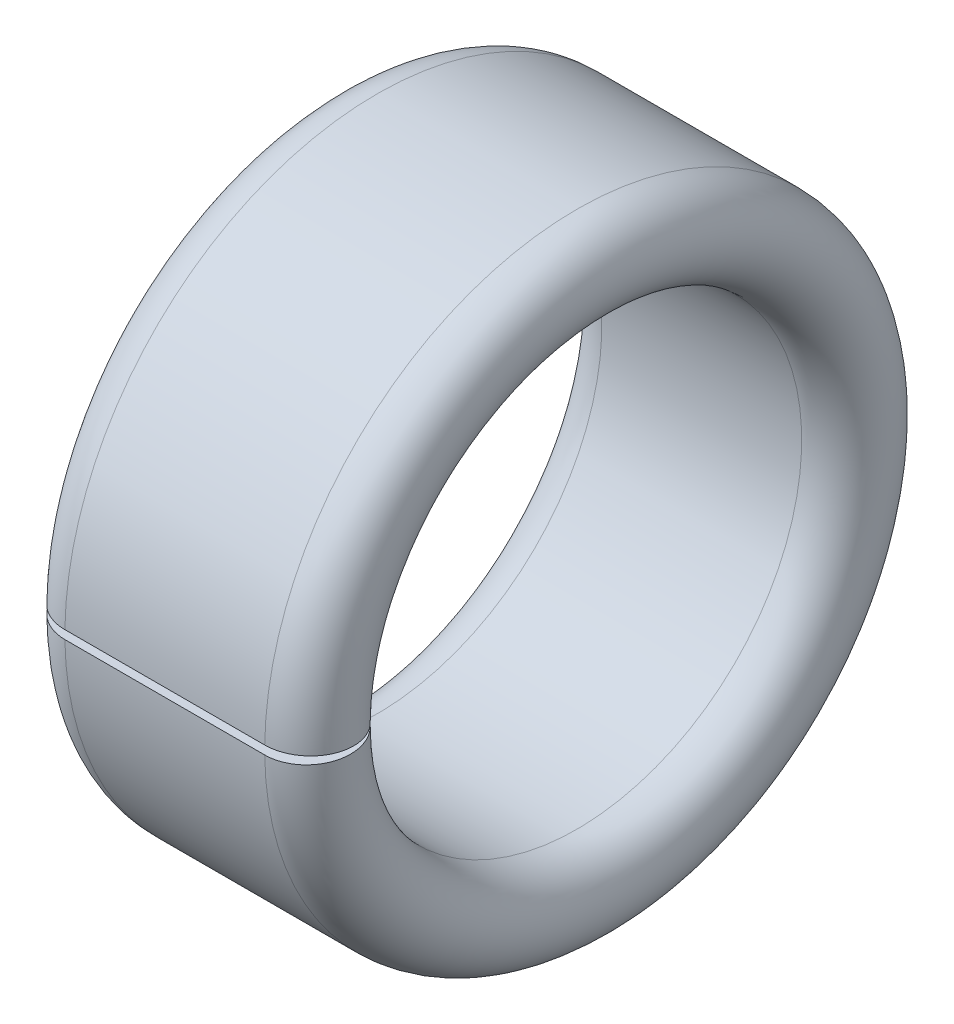
ISO-10303-21;
HEADER;
FILE_DESCRIPTION(('STEP AP214'),'2;1');
FILE_NAME('part.step','',(''),(''),'','','');
FILE_SCHEMA(('AUTOMOTIVE_DESIGN { 1 0 10303 214 1 1 1 1 }'));
ENDSEC;
DATA;
#1=APPLICATION_CONTEXT('core data for automotive mechanical design processes');
#2=APPLICATION_PROTOCOL_DEFINITION('international standard','automotive_design',2000,#1);
#3=PRODUCT_CONTEXT('',#1,'mechanical');
#4=PRODUCT('Part','Part','',(#3));
#5=PRODUCT_RELATED_PRODUCT_CATEGORY('part','',(#4));
#6=PRODUCT_DEFINITION_FORMATION('','',#4);
#7=PRODUCT_DEFINITION_CONTEXT('part definition',#1,'design');
#8=PRODUCT_DEFINITION('design','',#6,#7);
#9=PRODUCT_DEFINITION_SHAPE('','',#8);
#10=(LENGTH_UNIT() NAMED_UNIT(*) SI_UNIT(.MILLI.,.METRE.));
#11=(NAMED_UNIT(*) PLANE_ANGLE_UNIT() SI_UNIT($,.RADIAN.));
#12=(NAMED_UNIT(*) SI_UNIT($,.STERADIAN.) SOLID_ANGLE_UNIT());
#13=UNCERTAINTY_MEASURE_WITH_UNIT(LENGTH_MEASURE(1.E-05),#10,'distance_accuracy_value','');
#14=(GEOMETRIC_REPRESENTATION_CONTEXT(3) GLOBAL_UNCERTAINTY_ASSIGNED_CONTEXT((#13)) GLOBAL_UNIT_ASSIGNED_CONTEXT((#10,
#11,#12)) REPRESENTATION_CONTEXT('',''));
#15=CARTESIAN_POINT('',(0.,0.,0.));
#16=DIRECTION('',(0.,0.,1.));
#17=DIRECTION('',(1.,0.,0.));
#18=AXIS2_PLACEMENT_3D('',#15,#16,#17);
#19=CARTESIAN_POINT('',(0.35,0.,0.));
#20=DIRECTION('',(1.,0.,0.));
#21=DIRECTION('',(0.,0.,-1.));
#22=AXIS2_PLACEMENT_3D('',#19,#20,#21);
#23=TOROIDAL_SURFACE('',#22,2.15,0.35);
#24=CARTESIAN_POINT('',(0.35,0.,0.));
#25=DIRECTION('',(1.,0.,0.));
#26=DIRECTION('',(0.,0.,-1.));
#27=AXIS2_PLACEMENT_3D('',#24,#25,#26);
#28=CIRCLE('',#27,2.5);
#29=CARTESIAN_POINT('',(0.35,-0.034437225614834,2.49976280424603));
#30=VERTEX_POINT('',#29);
#31=CARTESIAN_POINT('',(0.35,0.0344372256148345,2.49976280424603));
#32=VERTEX_POINT('',#31);
#33=EDGE_CURVE('E85',#30,#32,#28,.T.);
#34=ORIENTED_EDGE('',*,*,#33,.F.);
#35=CARTESIAN_POINT('',(0.350199999999993,-0.0344372236201316,2.49976274712522));
#36=CARTESIAN_POINT('',(0.330513458890037,-0.0344382003940765,2.49979071827131));
#37=CARTESIAN_POINT('',(0.310830965609943,-0.0343800637703141,2.49812590318823));
#38=CARTESIAN_POINT('',(0.272035014909187,-0.0341498576529001,2.49153366250269));
#39=CARTESIAN_POINT('',(0.252921148691738,-0.0339778721822131,2.48660864300312));
#40=CARTESIAN_POINT('',(0.215784172977495,-0.0335241464089628,2.47361563683933));
#41=CARTESIAN_POINT('',(0.197761571854169,-0.0332423554003737,2.46554619814453));
#42=CARTESIAN_POINT('',(0.163330811070095,-0.0325772791095271,2.44650090502738));
#43=CARTESIAN_POINT('',(0.146922337413878,-0.0321940136208154,2.43552561741803));
#44=CARTESIAN_POINT('',(0.116179705652343,-0.0313367501225348,2.41097680275107));
#45=CARTESIAN_POINT('',(0.101845779744151,-0.0308627419702157,2.39740298524309));
#46=CARTESIAN_POINT('',(0.0756588001346326,-0.0298374149458111,2.36804146087442));
#47=CARTESIAN_POINT('',(0.0638061264881228,-0.0292860842517538,2.35225341547675));
#48=CARTESIAN_POINT('',(0.0429186221217634,-0.0281217165310652,2.31891028651266));
#49=CARTESIAN_POINT('',(0.0338842737645812,-0.0275086689651767,2.3013549011414));
#50=CARTESIAN_POINT('',(0.0188926400177474,-0.0262383910918137,2.2649789022201));
#51=CARTESIAN_POINT('',(0.012935162053471,-0.0255811635523782,2.24615836793631));
#52=CARTESIAN_POINT('',(0.00426387190833058,-0.0242409560526566,2.20777984652262));
#53=CARTESIAN_POINT('',(0.00155093851061013,-0.0235579691671118,2.18822166107925));
#54=CARTESIAN_POINT('',(-0.000551639414875153,-0.0221857771979768,2.14892722429832));
#55=CARTESIAN_POINT('',(5.87969882696782E-05,-0.021496571963365,2.12919096863606));
#56=CARTESIAN_POINT('',(0.00458610490793072,-0.0201313888480275,2.09009723916769));
#57=CARTESIAN_POINT('',(0.00850358486050442,-0.019455413424765,2.07073983573412));
#58=CARTESIAN_POINT('',(0.0195346148135306,-0.0181360101421559,2.03295706915102));
#59=CARTESIAN_POINT('',(0.0266481559721307,-0.0174925821927729,2.01453170342318));
#60=CARTESIAN_POINT('',(0.0438701104696195,-0.0162565018767181,1.97913499441461));
#61=CARTESIAN_POINT('',(0.0539787024048156,-0.015663852540717,1.96216373792093));
#62=CARTESIAN_POINT('',(0.0769034192872924,-0.0145462368081082,1.93015941072897));
#63=CARTESIAN_POINT('',(0.0897194111551644,-0.0140212670868214,1.91512624482434));
#64=CARTESIAN_POINT('',(0.117690994856155,-0.0130540545964116,1.88742890297056));
#65=CARTESIAN_POINT('',(0.132845828529518,-0.0126117851215345,1.87476396226868));
#66=CARTESIAN_POINT('',(0.165073826325424,-0.0118222226740318,1.85215385203931));
#67=CARTESIAN_POINT('',(0.18214758911785,-0.0114749594582661,1.84220953463681));
#68=CARTESIAN_POINT('',(0.217726978456363,-0.0108853833302602,1.82532628330567));
#69=CARTESIAN_POINT('',(0.236232945258549,-0.0106430954483228,1.81838806615113));
#70=CARTESIAN_POINT('',(0.274125105899796,-0.0102708983639453,1.80772973617173));
#71=CARTESIAN_POINT('',(0.293509915155594,-0.0101408184429499,1.80400473460709));
#72=CARTESIAN_POINT('',(0.325398207803402,-0.0100224549985587,1.80061524903406));
#73=CARTESIAN_POINT('',(0.3378025231833,-0.009999567069746,1.79995982450746));
#74=CARTESIAN_POINT('',(0.3502,-0.0100000019951171,1.79997227914054));
#75=B_SPLINE_CURVE_WITH_KNOTS('',3,(#35,#36,#37,#38,#39,#40,#41,#42,#43,#44,#45,#46,#47,#48,#49,
#50,#51,#52,#53,#54,#55,#56,#57,#58,#59,#60,#61,#62,#63,#64,#65,#66,#67,#68,#69,#70,#71,#72,#73,
#74),.UNSPECIFIED.,.F.,.F.,(4,2,2,2,2,2,2,2,2,2,2,2,2,2,2,2,2,2,2,4),(0.,0.0589811664257136,
0.117918851905634,0.176883785957539,0.235837226810727,0.294797261029061,0.353766319592167,
0.412745465311087,0.471720919206101,0.530712342956034,0.589705203275241,0.648708919577286,
0.707712472647497,0.766719544836096,0.825723717268441,0.884708802907901,0.943712342139064,
1.00272994243301,1.06165759135075,1.09884949494485),.UNSPECIFIED.);
#76=CARTESIAN_POINT('',(0.35,-0.0100000000000007,1.79997222200788));
#77=VERTEX_POINT('',#76);
#78=EDGE_CURVE('E64',#30,#77,#75,.T.);
#79=ORIENTED_EDGE('',*,*,#78,.T.);
#80=CARTESIAN_POINT('',(0.35,0.,0.));
#81=DIRECTION('',(1.,0.,0.));
#82=DIRECTION('',(0.,0.,-1.));
#83=AXIS2_PLACEMENT_3D('',#80,#81,#82);
#84=CIRCLE('',#83,1.8);
#85=CARTESIAN_POINT('',(0.35,0.0100000000000008,1.79997222200788));
#86=VERTEX_POINT('',#85);
#87=EDGE_CURVE('E87',#77,#86,#84,.T.);
#88=ORIENTED_EDGE('',*,*,#87,.T.);
#89=CARTESIAN_POINT('',(0.3502,0.0100000019951173,1.79997227914054));
#90=CARTESIAN_POINT('',(0.330515938498373,0.00999902429166176,1.79994428137676));
#91=CARTESIAN_POINT('',(0.310835961254501,0.0100571591381759,1.8016090455661));
#92=CARTESIAN_POINT('',(0.272045185273763,0.0102873517463833,1.80820089939858));
#93=CARTESIAN_POINT('',(0.252933973377943,0.0104593245939787,1.81312555742011));
#94=CARTESIAN_POINT('',(0.215802252574514,0.010913006349621,1.82611730308452));
#95=CARTESIAN_POINT('',(0.197782248660242,0.0111947656233416,1.83418583301159));
#96=CARTESIAN_POINT('',(0.163356222514488,0.0118597514005395,1.85322853415697));
#97=CARTESIAN_POINT('',(0.146949890510401,0.0122429583770062,1.86420214619485));
#98=CARTESIAN_POINT('',(0.116208852031249,0.0131001253164631,1.88874819577888));
#99=CARTESIAN_POINT('',(0.101874628389184,0.0135741063715801,1.90232123732451));
#100=CARTESIAN_POINT('',(0.0756864298511128,0.0145993681379304,1.93168089294701));
#101=CARTESIAN_POINT('',(0.0638328365701148,0.0151506607208536,1.94746784698459));
#102=CARTESIAN_POINT('',(0.0429408569269419,0.0163150478121653,1.98081153065075));
#103=CARTESIAN_POINT('',(0.0339034415809807,0.0169281635408999,1.99836886795053));
#104=CARTESIAN_POINT('',(0.0189059527384616,0.018198594106753,2.03474923941266));
#105=CARTESIAN_POINT('',(0.0129456877382525,0.0188559061904733,2.053572194728));
#106=CARTESIAN_POINT('',(0.0042692865198731,0.0201963137416161,2.09195644486486));
#107=CARTESIAN_POINT('',(0.00155410028383804,0.0208794166988561,2.11151795416669));
#108=CARTESIAN_POINT('',(-0.000551891446526203,0.0222518520487528,2.15081936046076));
#109=CARTESIAN_POINT('',(5.73814973008942E-05,0.0229411845880087,2.17055926165105));
#110=CARTESIAN_POINT('',(0.0045834806945544,0.0243065240678065,2.2096574688117));
#111=CARTESIAN_POINT('',(0.00850044204764825,0.0249825304628994,2.22901575916245));
#112=CARTESIAN_POINT('',(0.0195311834193477,0.0263019902026011,2.26680014246516));
#113=CARTESIAN_POINT('',(0.0266449509364822,0.0269454436745008,2.28522623906225));
#114=CARTESIAN_POINT('',(0.0438666278357914,0.0281814497960515,2.32062082341821));
#115=CARTESIAN_POINT('',(0.0539741867901772,0.0287740083925582,2.33758948147275));
#116=CARTESIAN_POINT('',(0.0768965581244986,0.0298914453275343,2.36958868857041));
#117=CARTESIAN_POINT('',(0.0897112361825411,0.0304163270219176,2.38461933371434));
#118=CARTESIAN_POINT('',(0.117679090604668,0.0313833471943485,2.41231116830176));
#119=CARTESIAN_POINT('',(0.132831391788907,0.0318255165024694,2.42497324060304));
#120=CARTESIAN_POINT('',(0.165053643126108,0.0326149080081673,2.44757845569959));
#121=CARTESIAN_POINT('',(0.182124192558459,0.032962100417046,2.45752074545814));
#122=CARTESIAN_POINT('',(0.217698838841015,0.0335516179580683,2.47440231907758));
#123=CARTESIAN_POINT('',(0.236203457411164,0.033793904711969,2.48134050392937));
#124=CARTESIAN_POINT('',(0.274092823059593,0.0341661314736564,2.49199968375573));
#125=CARTESIAN_POINT('',(0.29347618808616,0.0342962418678955,2.49572555795991));
#126=CARTESIAN_POINT('',(0.325374713458365,0.0344147320832872,2.49911867377941));
#127=CARTESIAN_POINT('',(0.337790777653349,0.03443765875606,2.49977520778787));
#128=CARTESIAN_POINT('',(0.350199999999993,0.0344372236201321,2.49976274712522));
#129=B_SPLINE_CURVE_WITH_KNOTS('',3,(#89,#90,#91,#92,#93,#94,#95,#96,#97,#98,#99,#100,#101,#102,
#103,#104,#105,#106,#107,#108,#109,#110,#111,#112,#113,#114,#115,#116,#117,#118,#119,#120,#121,
#122,#123,#124,#125,#126,#127,#128),.UNSPECIFIED.,.F.,.F.,(4,2,2,2,2,2,2,2,2,2,2,2,2,2,2,2,2,2,
2,4),(0.,0.058973663687536,0.117903387205865,0.176860177242991,0.235805627310535,
0.294764790507213,0.35373301720201,0.412721553660604,0.471706418578654,0.53070854682295,
0.589712067184856,0.648717997611003,0.707723697289811,0.766722492990353,0.825718361974688,
0.884692196930312,0.943684507376887,1.00269838112451,1.06162245904358,1.09884955945064),.UNSPECIFIED.);
#130=EDGE_CURVE('E83',#86,#32,#129,.T.);
#131=ORIENTED_EDGE('',*,*,#130,.T.);
#132=EDGE_LOOP('',(#34,#79,#88,#131));
#133=FACE_BOUND('',#132,.T.);
#134=ADVANCED_FACE('F40',(#133),#23,.T.);
#135=CARTESIAN_POINT('',(2.3,0.,0.));
#136=DIRECTION('',(1.,0.,0.));
#137=DIRECTION('',(0.,0.,-1.));
#138=AXIS2_PLACEMENT_3D('',#135,#136,#137);
#139=CYLINDRICAL_SURFACE('',#138,1.8);
#140=ORIENTED_EDGE('',*,*,#87,.F.);
#141=DIRECTION('',(1.,0.,0.));
#142=VECTOR('',#141,1.);
#143=CARTESIAN_POINT('',(2.3,-0.0100000000000007,1.79997222200788));
#144=LINE('',#143,#142);
#145=CARTESIAN_POINT('',(1.95,-0.0100000000000007,1.79997222200788));
#146=VERTEX_POINT('',#145);
#147=EDGE_CURVE('E105',#77,#146,#144,.T.);
#148=ORIENTED_EDGE('',*,*,#147,.T.);
#149=CARTESIAN_POINT('',(1.95,0.,0.));
#150=DIRECTION('',(1.,0.,0.));
#151=DIRECTION('',(0.,0.,-1.));
#152=AXIS2_PLACEMENT_3D('',#149,#150,#151);
#153=CIRCLE('',#152,1.8);
#154=CARTESIAN_POINT('',(1.95,0.0100000000000008,1.79997222200788));
#155=VERTEX_POINT('',#154);
#156=EDGE_CURVE('E103',#146,#155,#153,.T.);
#157=ORIENTED_EDGE('',*,*,#156,.T.);
#158=DIRECTION('',(1.,0.,0.));
#159=VECTOR('',#158,1.);
#160=CARTESIAN_POINT('',(2.3,0.0100000000000008,1.79997222200788));
#161=LINE('',#160,#159);
#162=EDGE_CURVE('E127',#155,#86,#161,.F.);
#163=ORIENTED_EDGE('',*,*,#162,.T.);
#164=EDGE_LOOP('',(#140,#148,#157,#163));
#165=FACE_BOUND('',#164,.T.);
#166=ADVANCED_FACE('F126',(#165),#139,.F.);
#167=CARTESIAN_POINT('',(2.3,0.,0.));
#168=DIRECTION('',(1.,0.,0.));
#169=DIRECTION('',(0.,0.,-1.));
#170=AXIS2_PLACEMENT_3D('',#167,#168,#169);
#171=CYLINDRICAL_SURFACE('',#170,2.5);
#172=CARTESIAN_POINT('',(1.95,0.,0.));
#173=DIRECTION('',(1.,0.,0.));
#174=DIRECTION('',(0.,0.,-1.));
#175=AXIS2_PLACEMENT_3D('',#172,#173,#174);
#176=CIRCLE('',#175,2.5);
#177=CARTESIAN_POINT('',(1.95,-0.034437225614834,2.49976280424603));
#178=VERTEX_POINT('',#177);
#179=CARTESIAN_POINT('',(1.95,0.0344372256148345,2.49976280424603));
#180=VERTEX_POINT('',#179);
#181=EDGE_CURVE('E98',#178,#180,#176,.T.);
#182=ORIENTED_EDGE('',*,*,#181,.F.);
#183=DIRECTION('',(1.,0.,0.));
#184=VECTOR('',#183,1.);
#185=CARTESIAN_POINT('',(2.3,-0.034437225614834,2.49976280424603));
#186=LINE('',#185,#184);
#187=EDGE_CURVE('E11',#178,#30,#186,.F.);
#188=ORIENTED_EDGE('',*,*,#187,.T.);
#189=ORIENTED_EDGE('',*,*,#33,.T.);
#190=DIRECTION('',(1.,0.,0.));
#191=VECTOR('',#190,1.);
#192=CARTESIAN_POINT('',(2.3,0.0344372256148345,2.49976280424603));
#193=LINE('',#192,#191);
#194=EDGE_CURVE('E49',#32,#180,#193,.T.);
#195=ORIENTED_EDGE('',*,*,#194,.T.);
#196=EDGE_LOOP('',(#182,#188,#189,#195));
#197=FACE_BOUND('',#196,.T.);
#198=ADVANCED_FACE('F96',(#197),#171,.T.);
#199=CARTESIAN_POINT('',(1.95,0.,0.));
#200=DIRECTION('',(1.,0.,0.));
#201=DIRECTION('',(0.,0.,-1.));
#202=AXIS2_PLACEMENT_3D('',#199,#200,#201);
#203=TOROIDAL_SURFACE('',#202,2.15,0.35);
#204=ORIENTED_EDGE('',*,*,#156,.F.);
#205=CARTESIAN_POINT('',(1.9498,-0.0100000019951171,1.79997227914054));
#206=CARTESIAN_POINT('',(1.96948406150163,-0.00999902429166162,1.79994428137676));
#207=CARTESIAN_POINT('',(1.9891640387455,-0.0100571591381757,1.8016090455661));
#208=CARTESIAN_POINT('',(2.02795481472624,-0.0102873517463831,1.80820089939858));
#209=CARTESIAN_POINT('',(2.04706602662206,-0.0104593245939786,1.81312555742011));
#210=CARTESIAN_POINT('',(2.08419774742549,-0.0109130063496209,1.82611730308452));
#211=CARTESIAN_POINT('',(2.10221775133976,-0.0111947656233414,1.83418583301159));
#212=CARTESIAN_POINT('',(2.13664377748551,-0.0118597514005393,1.85322853415697));
#213=CARTESIAN_POINT('',(2.1530501094896,-0.0122429583770061,1.86420214619485));
#214=CARTESIAN_POINT('',(2.18379114796875,-0.013100125316463,1.88874819577888));
#215=CARTESIAN_POINT('',(2.19812537161082,-0.0135741063715799,1.90232123732451));
#216=CARTESIAN_POINT('',(2.22431357014889,-0.0145993681379302,1.93168089294701));
#217=CARTESIAN_POINT('',(2.23616716342988,-0.0151506607208534,1.94746784698459));
#218=CARTESIAN_POINT('',(2.25705914307306,-0.0163150478121651,1.98081153065075));
#219=CARTESIAN_POINT('',(2.26609655841902,-0.0169281635408996,1.99836886795053));
#220=CARTESIAN_POINT('',(2.28109404726154,-0.0181985941067527,2.03474923941266));
#221=CARTESIAN_POINT('',(2.28705431226175,-0.018855906190473,2.053572194728));
#222=CARTESIAN_POINT('',(2.29573071348013,-0.0201963137416158,2.09195644486485));
#223=CARTESIAN_POINT('',(2.29844589971616,-0.0208794166988557,2.11151795416669));
#224=CARTESIAN_POINT('',(2.30055189144653,-0.0222518520487524,2.15081936046076));
#225=CARTESIAN_POINT('',(2.2999426185027,-0.0229411845880084,2.17055926165105));
#226=CARTESIAN_POINT('',(2.29541651930545,-0.0243065240678061,2.2096574688117));
#227=CARTESIAN_POINT('',(2.29149955795235,-0.024982530462899,2.22901575916245));
#228=CARTESIAN_POINT('',(2.28046881658065,-0.0263019902026007,2.26680014246516));
#229=CARTESIAN_POINT('',(2.27335504906352,-0.0269454436745005,2.28522623906225));
#230=CARTESIAN_POINT('',(2.25613337216421,-0.0281814497960511,2.32062082341821));
#231=CARTESIAN_POINT('',(2.24602581320982,-0.0287740083925578,2.33758948147275));
#232=CARTESIAN_POINT('',(2.2231034418755,-0.0298914453275339,2.36958868857041));
#233=CARTESIAN_POINT('',(2.21028876381746,-0.0304163270219172,2.38461933371434));
#234=CARTESIAN_POINT('',(2.18232090939533,-0.0313833471943481,2.41231116830176));
#235=CARTESIAN_POINT('',(2.16716860821109,-0.0318255165024689,2.42497324060304));
#236=CARTESIAN_POINT('',(2.13494635687389,-0.0326149080081669,2.44757845569959));
#237=CARTESIAN_POINT('',(2.11787580744154,-0.0329621004170456,2.45752074545814));
#238=CARTESIAN_POINT('',(2.08230116115899,-0.0335516179580679,2.47440231907758));
#239=CARTESIAN_POINT('',(2.06379654258884,-0.0337939047119685,2.48134050392937));
#240=CARTESIAN_POINT('',(2.02590717694041,-0.0341661314736559,2.49199968375573));
#241=CARTESIAN_POINT('',(2.00652381191384,-0.034296241867895,2.49572555795991));
#242=CARTESIAN_POINT('',(1.97462528654164,-0.0344147320832868,2.49911867377941));
#243=CARTESIAN_POINT('',(1.96220922234665,-0.0344376587560595,2.49977520778787));
#244=CARTESIAN_POINT('',(1.94980000000001,-0.0344372236201316,2.49976274712522));
#245=B_SPLINE_CURVE_WITH_KNOTS('',3,(#205,#206,#207,#208,#209,#210,#211,#212,#213,#214,#215,
#216,#217,#218,#219,#220,#221,#222,#223,#224,#225,#226,#227,#228,#229,#230,#231,#232,#233,#234,
#235,#236,#237,#238,#239,#240,#241,#242,#243,#244),.UNSPECIFIED.,.F.,.F.,(4,2,2,2,2,2,2,2,2,2,2,
2,2,2,2,2,2,2,2,4),(0.,0.0589736636875356,0.117903387205865,0.17686017724299,0.235805627310535,
0.294764790507213,0.35373301720201,0.412721553660604,0.471706418578654,0.53070854682295,
0.589712067184856,0.648717997611003,0.707723697289811,0.766722492990354,0.825718361974688,
0.884692196930312,0.943684507376887,1.00269838112451,1.06162245904358,1.09884955945064),.UNSPECIFIED.);
#246=EDGE_CURVE('E130',#146,#178,#245,.T.);
#247=ORIENTED_EDGE('',*,*,#246,.T.);
#248=ORIENTED_EDGE('',*,*,#181,.T.);
#249=CARTESIAN_POINT('',(1.94980000000001,0.0344372236201321,2.49976274712522));
#250=CARTESIAN_POINT('',(1.96948654110996,0.034438200394077,2.49979071827131));
#251=CARTESIAN_POINT('',(1.98916903439006,0.0343800637703146,2.49812590318823));
#252=CARTESIAN_POINT('',(2.02796498509081,0.0341498576529006,2.49153366250269));
#253=CARTESIAN_POINT('',(2.04707885130826,0.0339778721822136,2.48660864300312));
#254=CARTESIAN_POINT('',(2.0842158270225,0.0335241464089633,2.47361563683933));
#255=CARTESIAN_POINT('',(2.10223842814583,0.0332423554003742,2.46554619814453));
#256=CARTESIAN_POINT('',(2.1366691889299,0.0325772791095276,2.44650090502738));
#257=CARTESIAN_POINT('',(2.15307766258612,0.0321940136208159,2.43552561741803));
#258=CARTESIAN_POINT('',(2.18382029434766,0.0313367501225353,2.41097680275107));
#259=CARTESIAN_POINT('',(2.19815422025585,0.0308627419702161,2.39740298524309));
#260=CARTESIAN_POINT('',(2.22434119986537,0.0298374149458115,2.36804146087442));
#261=CARTESIAN_POINT('',(2.23619387351188,0.0292860842517542,2.35225341547675));
#262=CARTESIAN_POINT('',(2.25708137787824,0.0281217165310656,2.31891028651266));
#263=CARTESIAN_POINT('',(2.26611572623542,0.0275086689651771,2.3013549011414));
#264=CARTESIAN_POINT('',(2.28110735998225,0.0262383910918141,2.2649789022201));
#265=CARTESIAN_POINT('',(2.28706483794653,0.0255811635523786,2.24615836793631));
#266=CARTESIAN_POINT('',(2.29573612809167,0.024240956052657,2.20777984652262));
#267=CARTESIAN_POINT('',(2.29844906148939,0.0235579691671122,2.18822166107925));
#268=CARTESIAN_POINT('',(2.30055163941488,0.0221857771979771,2.14892722429832));
#269=CARTESIAN_POINT('',(2.29994120301173,0.0214965719633653,2.12919096863606));
#270=CARTESIAN_POINT('',(2.29541389509207,0.0201313888480278,2.0900972391677));
#271=CARTESIAN_POINT('',(2.2914964151395,0.0194554134247653,2.07073983573412));
#272=CARTESIAN_POINT('',(2.28046538518647,0.0181360101421562,2.03295706915102));
#273=CARTESIAN_POINT('',(2.27335184402787,0.0174925821927731,2.01453170342318));
#274=CARTESIAN_POINT('',(2.25612988953038,0.0162565018767184,1.97913499441461));
#275=CARTESIAN_POINT('',(2.24602129759519,0.0156638525407173,1.96216373792093));
#276=CARTESIAN_POINT('',(2.22309658071271,0.0145462368081084,1.93015941072897));
#277=CARTESIAN_POINT('',(2.21028058884484,0.0140212670868217,1.91512624482434));
#278=CARTESIAN_POINT('',(2.18230900514385,0.0130540545964118,1.88742890297056));
#279=CARTESIAN_POINT('',(2.16715417147048,0.0126117851215347,1.87476396226868));
#280=CARTESIAN_POINT('',(2.13492617367458,0.011822222674032,1.85215385203931));
#281=CARTESIAN_POINT('',(2.11785241088215,0.0114749594582662,1.84220953463681));
#282=CARTESIAN_POINT('',(2.08227302154364,0.0108853833302604,1.82532628330567));
#283=CARTESIAN_POINT('',(2.06376705474145,0.0106430954483229,1.81838806615113));
#284=CARTESIAN_POINT('',(2.0258748941002,0.0102708983639455,1.80772973617173));
#285=CARTESIAN_POINT('',(2.00649008484441,0.0101408184429501,1.80400473460709));
#286=CARTESIAN_POINT('',(1.9746017921966,0.0100224549985589,1.80061524903406));
#287=CARTESIAN_POINT('',(1.9621974768167,0.00999956706974615,1.79995982450746));
#288=CARTESIAN_POINT('',(1.9498,0.0100000019951173,1.79997227914054));
#289=B_SPLINE_CURVE_WITH_KNOTS('',3,(#249,#250,#251,#252,#253,#254,#255,#256,#257,#258,#259,
#260,#261,#262,#263,#264,#265,#266,#267,#268,#269,#270,#271,#272,#273,#274,#275,#276,#277,#278,
#279,#280,#281,#282,#283,#284,#285,#286,#287,#288),.UNSPECIFIED.,.F.,.F.,(4,2,2,2,2,2,2,2,2,2,2,
2,2,2,2,2,2,2,2,4),(0.,0.0589811664257135,0.117918851905634,0.176883785957538,0.235837226810727,
0.294797261029061,0.353766319592167,0.412745465311086,0.4717209192061,0.530712342956034,
0.589705203275241,0.648708919577286,0.707712472647497,0.766719544836096,0.82572371726844,
0.884708802907901,0.943712342139063,1.00272994243301,1.06165759135075,1.09884949494485),.UNSPECIFIED.);
#290=EDGE_CURVE('E56',#180,#155,#289,.T.);
#291=ORIENTED_EDGE('',*,*,#290,.T.);
#292=EDGE_LOOP('',(#204,#247,#248,#291));
#293=FACE_BOUND('',#292,.T.);
#294=ADVANCED_FACE('F129',(#293),#203,.T.);
#295=CARTESIAN_POINT('',(2.3,0.,1.5136096891787));
#296=DIRECTION('',(0.,-0.999390827019096,0.0348994967025004));
#297=DIRECTION('',(0.,-0.0348994967025004,-0.999390827019096));
#298=AXIS2_PLACEMENT_3D('',#295,#296,#297);
#299=PLANE('',#298);
#300=ORIENTED_EDGE('',*,*,#290,.F.);
#301=ORIENTED_EDGE('',*,*,#194,.F.);
#302=ORIENTED_EDGE('',*,*,#130,.F.);
#303=ORIENTED_EDGE('',*,*,#162,.F.);
#304=EDGE_LOOP('',(#300,#301,#302,#303));
#305=FACE_BOUND('',#304,.T.);
#306=ADVANCED_FACE('F91',(#305),#299,.T.);
#307=CARTESIAN_POINT('',(2.3,-0.069342288469683,3.4993130250136));
#308=DIRECTION('',(0.,0.999390827019096,0.0348994967024999));
#309=DIRECTION('',(0.,-0.0348994967024999,0.999390827019096));
#310=AXIS2_PLACEMENT_3D('',#307,#308,#309);
#311=PLANE('',#310);
#312=ORIENTED_EDGE('',*,*,#187,.F.);
#313=ORIENTED_EDGE('',*,*,#246,.F.);
#314=ORIENTED_EDGE('',*,*,#147,.F.);
#315=ORIENTED_EDGE('',*,*,#78,.F.);
#316=EDGE_LOOP('',(#312,#313,#314,#315));
#317=FACE_BOUND('',#316,.T.);
#318=ADVANCED_FACE('F150',(#317),#311,.T.);
#319=CLOSED_SHELL('',(#134,#166,#198,#294,#306,#318));
#320=MANIFOLD_SOLID_BREP('B2',#319);
#321=ADVANCED_BREP_SHAPE_REPRESENTATION('',(#18,#320),#14);
#322=SHAPE_DEFINITION_REPRESENTATION(#9,#321);
ENDSEC;
END-ISO-10303-21;
